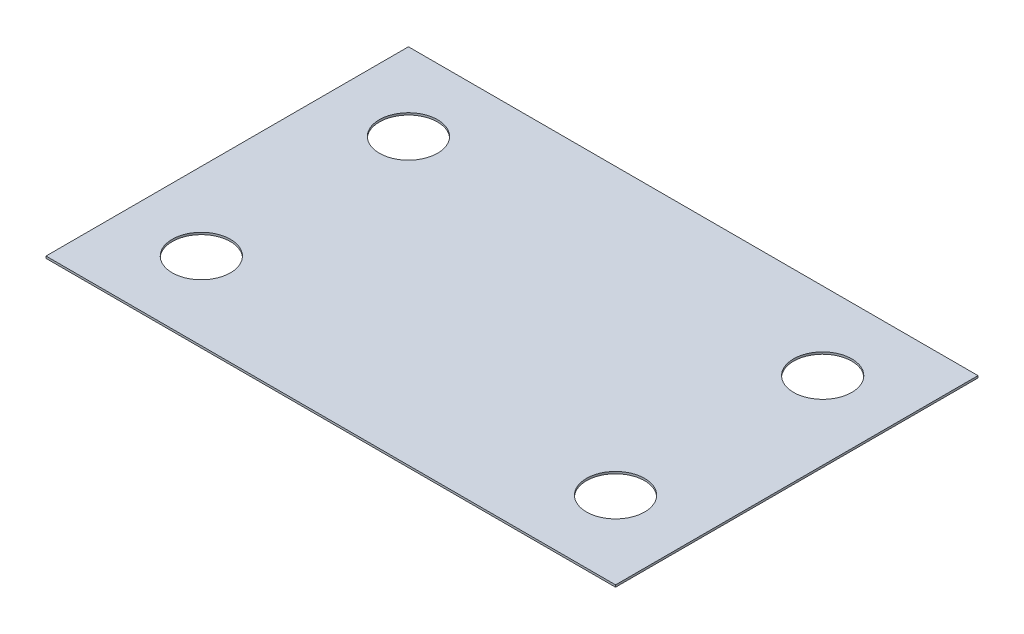
ISO-10303-21;
HEADER;
FILE_DESCRIPTION(('STEP AP214'),'2;1');
FILE_NAME('part.step','',(''),(''),'','','');
FILE_SCHEMA(('AUTOMOTIVE_DESIGN { 1 0 10303 214 1 1 1 1 }'));
ENDSEC;
DATA;
#1=APPLICATION_CONTEXT('core data for automotive mechanical design processes');
#2=APPLICATION_PROTOCOL_DEFINITION('international standard','automotive_design',2000,#1);
#3=PRODUCT_CONTEXT('',#1,'mechanical');
#4=PRODUCT('Part','Part','',(#3));
#5=PRODUCT_RELATED_PRODUCT_CATEGORY('part','',(#4));
#6=PRODUCT_DEFINITION_FORMATION('','',#4);
#7=PRODUCT_DEFINITION_CONTEXT('part definition',#1,'design');
#8=PRODUCT_DEFINITION('design','',#6,#7);
#9=PRODUCT_DEFINITION_SHAPE('','',#8);
#10=(LENGTH_UNIT() NAMED_UNIT(*) SI_UNIT(.MILLI.,.METRE.));
#11=(NAMED_UNIT(*) PLANE_ANGLE_UNIT() SI_UNIT($,.RADIAN.));
#12=(NAMED_UNIT(*) SI_UNIT($,.STERADIAN.) SOLID_ANGLE_UNIT());
#13=UNCERTAINTY_MEASURE_WITH_UNIT(LENGTH_MEASURE(1.E-05),#10,'distance_accuracy_value','');
#14=(GEOMETRIC_REPRESENTATION_CONTEXT(3) GLOBAL_UNCERTAINTY_ASSIGNED_CONTEXT((#13)) GLOBAL_UNIT_ASSIGNED_CONTEXT((#10,
#11,#12)) REPRESENTATION_CONTEXT('',''));
#15=CARTESIAN_POINT('',(0.,0.,0.));
#16=DIRECTION('',(0.,0.,1.));
#17=DIRECTION('',(1.,0.,0.));
#18=AXIS2_PLACEMENT_3D('',#15,#16,#17);
#19=CARTESIAN_POINT('',(0.,0.254,0.));
#20=DIRECTION('',(0.,-1.,0.));
#21=DIRECTION('',(0.,0.,-1.));
#22=AXIS2_PLACEMENT_3D('',#19,#20,#21);
#23=PLANE('',#22);
#24=DIRECTION('',(0.,0.,1.));
#25=VECTOR('',#24,1.);
#26=CARTESIAN_POINT('',(0.,0.254,0.));
#27=LINE('',#26,#25);
#28=CARTESIAN_POINT('',(0.,0.254,-44.45));
#29=VERTEX_POINT('',#28);
#30=CARTESIAN_POINT('',(0.,0.254,0.));
#31=VERTEX_POINT('',#30);
#32=EDGE_CURVE('E98',#29,#31,#27,.T.);
#33=ORIENTED_EDGE('',*,*,#32,.T.);
#34=DIRECTION('',(1.,0.,0.));
#35=VECTOR('',#34,1.);
#36=CARTESIAN_POINT('',(0.,0.254,0.));
#37=LINE('',#36,#35);
#38=CARTESIAN_POINT('',(69.85,0.254,0.));
#39=VERTEX_POINT('',#38);
#40=EDGE_CURVE('E93',#31,#39,#37,.T.);
#41=ORIENTED_EDGE('',*,*,#40,.T.);
#42=DIRECTION('',(0.,0.,-1.));
#43=VECTOR('',#42,1.);
#44=CARTESIAN_POINT('',(69.85,0.254,0.));
#45=LINE('',#44,#43);
#46=CARTESIAN_POINT('',(69.85,0.254,-44.45));
#47=VERTEX_POINT('',#46);
#48=EDGE_CURVE('E96',#39,#47,#45,.T.);
#49=ORIENTED_EDGE('',*,*,#48,.T.);
#50=DIRECTION('',(-1.,0.,0.));
#51=VECTOR('',#50,1.);
#52=CARTESIAN_POINT('',(0.,0.254,-44.45));
#53=LINE('',#52,#51);
#54=EDGE_CURVE('E63',#47,#29,#53,.T.);
#55=ORIENTED_EDGE('',*,*,#54,.T.);
#56=EDGE_LOOP('',(#33,#41,#49,#55));
#57=FACE_BOUND('',#56,.T.);
#58=CARTESIAN_POINT('',(9.525,0.254,-9.525));
#59=DIRECTION('',(0.,1.,0.));
#60=DIRECTION('',(0.,0.,1.));
#61=AXIS2_PLACEMENT_3D('',#58,#59,#60);
#62=CIRCLE('',#61,3.5687);
#63=CARTESIAN_POINT('',(9.525,0.254,-5.9563));
#64=VERTEX_POINT('',#63);
#65=EDGE_CURVE('E118',#64,#64,#62,.T.);
#66=ORIENTED_EDGE('',*,*,#65,.F.);
#67=EDGE_LOOP('',(#66));
#68=FACE_BOUND('',#67,.T.);
#69=CARTESIAN_POINT('',(9.525,0.254,-34.925));
#70=DIRECTION('',(0.,1.,0.));
#71=DIRECTION('',(0.,0.,1.));
#72=AXIS2_PLACEMENT_3D('',#69,#70,#71);
#73=CIRCLE('',#72,3.5687);
#74=CARTESIAN_POINT('',(9.525,0.254,-31.3563));
#75=VERTEX_POINT('',#74);
#76=EDGE_CURVE('E140',#75,#75,#73,.T.);
#77=ORIENTED_EDGE('',*,*,#76,.F.);
#78=EDGE_LOOP('',(#77));
#79=FACE_BOUND('',#78,.T.);
#80=CARTESIAN_POINT('',(60.325,0.254,-9.525));
#81=DIRECTION('',(0.,1.,0.));
#82=DIRECTION('',(0.,0.,1.));
#83=AXIS2_PLACEMENT_3D('',#80,#81,#82);
#84=CIRCLE('',#83,3.56870000000001);
#85=CARTESIAN_POINT('',(60.325,0.254,-5.95629999999999));
#86=VERTEX_POINT('',#85);
#87=EDGE_CURVE('E148',#86,#86,#84,.T.);
#88=ORIENTED_EDGE('',*,*,#87,.F.);
#89=EDGE_LOOP('',(#88));
#90=FACE_BOUND('',#89,.T.);
#91=CARTESIAN_POINT('',(60.325,0.254,-34.925));
#92=DIRECTION('',(0.,1.,0.));
#93=DIRECTION('',(0.,0.,1.));
#94=AXIS2_PLACEMENT_3D('',#91,#92,#93);
#95=CIRCLE('',#94,3.56870000000001);
#96=CARTESIAN_POINT('',(60.325,0.254,-31.3563));
#97=VERTEX_POINT('',#96);
#98=EDGE_CURVE('E156',#97,#97,#95,.T.);
#99=ORIENTED_EDGE('',*,*,#98,.F.);
#100=EDGE_LOOP('',(#99));
#101=FACE_BOUND('',#100,.T.);
#102=ADVANCED_FACE('F45',(#57,#68,#79,#90,#101),#23,.F.);
#103=CARTESIAN_POINT('',(0.,0.,0.));
#104=DIRECTION('',(0.,-1.,0.));
#105=DIRECTION('',(0.,0.,-1.));
#106=AXIS2_PLACEMENT_3D('',#103,#104,#105);
#107=PLANE('',#106);
#108=CARTESIAN_POINT('',(60.325,0.,-9.525));
#109=DIRECTION('',(0.,1.,0.));
#110=DIRECTION('',(0.,0.,1.));
#111=AXIS2_PLACEMENT_3D('',#108,#109,#110);
#112=CIRCLE('',#111,3.56870000000001);
#113=CARTESIAN_POINT('',(60.325,0.,-5.95629999999999));
#114=VERTEX_POINT('',#113);
#115=EDGE_CURVE('E152',#114,#114,#112,.T.);
#116=ORIENTED_EDGE('',*,*,#115,.T.);
#117=EDGE_LOOP('',(#116));
#118=FACE_BOUND('',#117,.T.);
#119=CARTESIAN_POINT('',(9.525,0.,-9.525));
#120=DIRECTION('',(0.,1.,0.));
#121=DIRECTION('',(0.,0.,1.));
#122=AXIS2_PLACEMENT_3D('',#119,#120,#121);
#123=CIRCLE('',#122,3.5687);
#124=CARTESIAN_POINT('',(9.525,0.,-5.9563));
#125=VERTEX_POINT('',#124);
#126=EDGE_CURVE('E136',#125,#125,#123,.T.);
#127=ORIENTED_EDGE('',*,*,#126,.T.);
#128=EDGE_LOOP('',(#127));
#129=FACE_BOUND('',#128,.T.);
#130=DIRECTION('',(0.,0.,1.));
#131=VECTOR('',#130,1.);
#132=CARTESIAN_POINT('',(0.,0.,0.));
#133=LINE('',#132,#131);
#134=CARTESIAN_POINT('',(0.,0.,-44.45));
#135=VERTEX_POINT('',#134);
#136=CARTESIAN_POINT('',(0.,0.,0.));
#137=VERTEX_POINT('',#136);
#138=EDGE_CURVE('E114',#135,#137,#133,.T.);
#139=ORIENTED_EDGE('',*,*,#138,.F.);
#140=DIRECTION('',(-1.,0.,0.));
#141=VECTOR('',#140,1.);
#142=CARTESIAN_POINT('',(0.,0.,-44.45));
#143=LINE('',#142,#141);
#144=CARTESIAN_POINT('',(69.85,0.,-44.45));
#145=VERTEX_POINT('',#144);
#146=EDGE_CURVE('E86',#145,#135,#143,.T.);
#147=ORIENTED_EDGE('',*,*,#146,.F.);
#148=DIRECTION('',(0.,0.,-1.));
#149=VECTOR('',#148,1.);
#150=CARTESIAN_POINT('',(69.85,0.,0.));
#151=LINE('',#150,#149);
#152=CARTESIAN_POINT('',(69.85,0.,0.));
#153=VERTEX_POINT('',#152);
#154=EDGE_CURVE('E80',#153,#145,#151,.T.);
#155=ORIENTED_EDGE('',*,*,#154,.F.);
#156=DIRECTION('',(1.,0.,0.));
#157=VECTOR('',#156,1.);
#158=CARTESIAN_POINT('',(0.,0.,0.));
#159=LINE('',#158,#157);
#160=EDGE_CURVE('E103',#137,#153,#159,.T.);
#161=ORIENTED_EDGE('',*,*,#160,.F.);
#162=EDGE_LOOP('',(#139,#147,#155,#161));
#163=FACE_BOUND('',#162,.T.);
#164=CARTESIAN_POINT('',(9.525,0.,-34.925));
#165=DIRECTION('',(0.,1.,0.));
#166=DIRECTION('',(0.,0.,1.));
#167=AXIS2_PLACEMENT_3D('',#164,#165,#166);
#168=CIRCLE('',#167,3.5687);
#169=CARTESIAN_POINT('',(9.525,0.,-31.3563));
#170=VERTEX_POINT('',#169);
#171=EDGE_CURVE('E144',#170,#170,#168,.T.);
#172=ORIENTED_EDGE('',*,*,#171,.T.);
#173=EDGE_LOOP('',(#172));
#174=FACE_BOUND('',#173,.T.);
#175=CARTESIAN_POINT('',(60.325,0.,-34.925));
#176=DIRECTION('',(0.,1.,0.));
#177=DIRECTION('',(0.,0.,1.));
#178=AXIS2_PLACEMENT_3D('',#175,#176,#177);
#179=CIRCLE('',#178,3.56870000000001);
#180=CARTESIAN_POINT('',(60.325,0.,-31.3563));
#181=VERTEX_POINT('',#180);
#182=EDGE_CURVE('E160',#181,#181,#179,.T.);
#183=ORIENTED_EDGE('',*,*,#182,.T.);
#184=EDGE_LOOP('',(#183));
#185=FACE_BOUND('',#184,.T.);
#186=ADVANCED_FACE('F131',(#118,#129,#163,#174,#185),#107,.T.);
#187=CARTESIAN_POINT('',(0.,0.254,0.));
#188=DIRECTION('',(1.,0.,0.));
#189=DIRECTION('',(0.,0.,-1.));
#190=AXIS2_PLACEMENT_3D('',#187,#188,#189);
#191=PLANE('',#190);
#192=ORIENTED_EDGE('',*,*,#138,.T.);
#193=DIRECTION('',(0.,-1.,0.));
#194=VECTOR('',#193,1.);
#195=CARTESIAN_POINT('',(0.,0.254,0.));
#196=LINE('',#195,#194);
#197=EDGE_CURVE('E11',#31,#137,#196,.T.);
#198=ORIENTED_EDGE('',*,*,#197,.F.);
#199=ORIENTED_EDGE('',*,*,#32,.F.);
#200=DIRECTION('',(0.,-1.,0.));
#201=VECTOR('',#200,1.);
#202=CARTESIAN_POINT('',(0.,0.254,-44.45));
#203=LINE('',#202,#201);
#204=EDGE_CURVE('E110',#29,#135,#203,.T.);
#205=ORIENTED_EDGE('',*,*,#204,.T.);
#206=EDGE_LOOP('',(#192,#198,#199,#205));
#207=FACE_BOUND('',#206,.T.);
#208=ADVANCED_FACE('F47',(#207),#191,.F.);
#209=CARTESIAN_POINT('',(0.,0.254,0.));
#210=DIRECTION('',(0.,0.,-1.));
#211=DIRECTION('',(-1.,0.,0.));
#212=AXIS2_PLACEMENT_3D('',#209,#210,#211);
#213=PLANE('',#212);
#214=ORIENTED_EDGE('',*,*,#160,.T.);
#215=DIRECTION('',(0.,-1.,0.));
#216=VECTOR('',#215,1.);
#217=CARTESIAN_POINT('',(69.85,0.254,0.));
#218=LINE('',#217,#216);
#219=EDGE_CURVE('E55',#39,#153,#218,.T.);
#220=ORIENTED_EDGE('',*,*,#219,.F.);
#221=ORIENTED_EDGE('',*,*,#40,.F.);
#222=ORIENTED_EDGE('',*,*,#197,.T.);
#223=EDGE_LOOP('',(#214,#220,#221,#222));
#224=FACE_BOUND('',#223,.T.);
#225=ADVANCED_FACE('F102',(#224),#213,.F.);
#226=CARTESIAN_POINT('',(69.85,0.254,0.));
#227=DIRECTION('',(-1.,0.,0.));
#228=DIRECTION('',(0.,0.,1.));
#229=AXIS2_PLACEMENT_3D('',#226,#227,#228);
#230=PLANE('',#229);
#231=ORIENTED_EDGE('',*,*,#154,.T.);
#232=DIRECTION('',(0.,-1.,0.));
#233=VECTOR('',#232,1.);
#234=CARTESIAN_POINT('',(69.85,0.254,-44.45));
#235=LINE('',#234,#233);
#236=EDGE_CURVE('E105',#47,#145,#235,.T.);
#237=ORIENTED_EDGE('',*,*,#236,.F.);
#238=ORIENTED_EDGE('',*,*,#48,.F.);
#239=ORIENTED_EDGE('',*,*,#219,.T.);
#240=EDGE_LOOP('',(#231,#237,#238,#239));
#241=FACE_BOUND('',#240,.T.);
#242=ADVANCED_FACE('F106',(#241),#230,.F.);
#243=CARTESIAN_POINT('',(0.,0.254,-44.45));
#244=DIRECTION('',(0.,0.,1.));
#245=DIRECTION('',(1.,0.,0.));
#246=AXIS2_PLACEMENT_3D('',#243,#244,#245);
#247=PLANE('',#246);
#248=ORIENTED_EDGE('',*,*,#146,.T.);
#249=ORIENTED_EDGE('',*,*,#204,.F.);
#250=ORIENTED_EDGE('',*,*,#54,.F.);
#251=ORIENTED_EDGE('',*,*,#236,.T.);
#252=EDGE_LOOP('',(#248,#249,#250,#251));
#253=FACE_BOUND('',#252,.T.);
#254=ADVANCED_FACE('F128',(#253),#247,.F.);
#255=CARTESIAN_POINT('',(9.525,0.254,-9.525));
#256=DIRECTION('',(0.,-1.,0.));
#257=DIRECTION('',(0.,0.,-1.));
#258=AXIS2_PLACEMENT_3D('',#255,#256,#257);
#259=CYLINDRICAL_SURFACE('',#258,3.5687);
#260=ORIENTED_EDGE('',*,*,#65,.T.);
#261=EDGE_LOOP('',(#260));
#262=FACE_BOUND('',#261,.T.);
#263=ORIENTED_EDGE('',*,*,#126,.F.);
#264=EDGE_LOOP('',(#263));
#265=FACE_BOUND('',#264,.T.);
#266=ADVANCED_FACE('F179',(#262,#265),#259,.F.);
#267=CARTESIAN_POINT('',(9.525,0.254,-34.925));
#268=DIRECTION('',(0.,-1.,0.));
#269=DIRECTION('',(0.,0.,-1.));
#270=AXIS2_PLACEMENT_3D('',#267,#268,#269);
#271=CYLINDRICAL_SURFACE('',#270,3.5687);
#272=ORIENTED_EDGE('',*,*,#76,.T.);
#273=EDGE_LOOP('',(#272));
#274=FACE_BOUND('',#273,.T.);
#275=ORIENTED_EDGE('',*,*,#171,.F.);
#276=EDGE_LOOP('',(#275));
#277=FACE_BOUND('',#276,.T.);
#278=ADVANCED_FACE('F224',(#274,#277),#271,.F.);
#279=CARTESIAN_POINT('',(60.325,0.254,-9.525));
#280=DIRECTION('',(0.,-1.,0.));
#281=DIRECTION('',(0.,0.,-1.));
#282=AXIS2_PLACEMENT_3D('',#279,#280,#281);
#283=CYLINDRICAL_SURFACE('',#282,3.56870000000001);
#284=ORIENTED_EDGE('',*,*,#87,.T.);
#285=EDGE_LOOP('',(#284));
#286=FACE_BOUND('',#285,.T.);
#287=ORIENTED_EDGE('',*,*,#115,.F.);
#288=EDGE_LOOP('',(#287));
#289=FACE_BOUND('',#288,.T.);
#290=ADVANCED_FACE('F232',(#286,#289),#283,.F.);
#291=CARTESIAN_POINT('',(60.325,0.254,-34.925));
#292=DIRECTION('',(0.,-1.,0.));
#293=DIRECTION('',(0.,0.,-1.));
#294=AXIS2_PLACEMENT_3D('',#291,#292,#293);
#295=CYLINDRICAL_SURFACE('',#294,3.56870000000001);
#296=ORIENTED_EDGE('',*,*,#98,.T.);
#297=EDGE_LOOP('',(#296));
#298=FACE_BOUND('',#297,.T.);
#299=ORIENTED_EDGE('',*,*,#182,.F.);
#300=EDGE_LOOP('',(#299));
#301=FACE_BOUND('',#300,.T.);
#302=ADVANCED_FACE('F168',(#298,#301),#295,.F.);
#303=CLOSED_SHELL('',(#102,#186,#208,#225,#242,#254,#266,#278,#290,#302));
#304=MANIFOLD_SOLID_BREP('B2',#303);
#305=ADVANCED_BREP_SHAPE_REPRESENTATION('',(#18,#304),#14);
#306=SHAPE_DEFINITION_REPRESENTATION(#9,#305);
ENDSEC;
END-ISO-10303-21;
